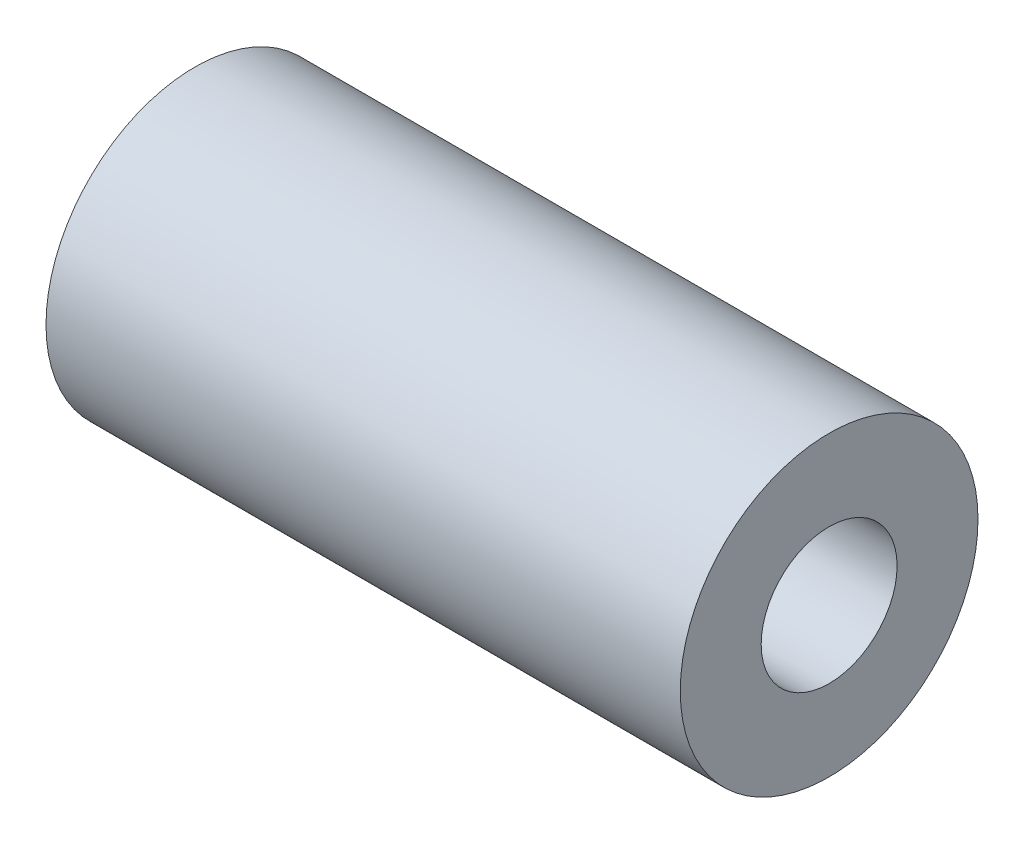
ISO-10303-21;
HEADER;
FILE_DESCRIPTION(('STEP AP214'),'2;1');
FILE_NAME('part.step','',(''),(''),'','','');
FILE_SCHEMA(('AUTOMOTIVE_DESIGN { 1 0 10303 214 1 1 1 1 }'));
ENDSEC;
DATA;
#1=APPLICATION_CONTEXT('core data for automotive mechanical design processes');
#2=APPLICATION_PROTOCOL_DEFINITION('international standard','automotive_design',2000,#1);
#3=PRODUCT_CONTEXT('',#1,'mechanical');
#4=PRODUCT('Part','Part','',(#3));
#5=PRODUCT_RELATED_PRODUCT_CATEGORY('part','',(#4));
#6=PRODUCT_DEFINITION_FORMATION('','',#4);
#7=PRODUCT_DEFINITION_CONTEXT('part definition',#1,'design');
#8=PRODUCT_DEFINITION('design','',#6,#7);
#9=PRODUCT_DEFINITION_SHAPE('','',#8);
#10=(LENGTH_UNIT() NAMED_UNIT(*) SI_UNIT(.MILLI.,.METRE.));
#11=(NAMED_UNIT(*) PLANE_ANGLE_UNIT() SI_UNIT($,.RADIAN.));
#12=(NAMED_UNIT(*) SI_UNIT($,.STERADIAN.) SOLID_ANGLE_UNIT());
#13=UNCERTAINTY_MEASURE_WITH_UNIT(LENGTH_MEASURE(1.E-05),#10,'distance_accuracy_value','');
#14=(GEOMETRIC_REPRESENTATION_CONTEXT(3) GLOBAL_UNCERTAINTY_ASSIGNED_CONTEXT((#13)) GLOBAL_UNIT_ASSIGNED_CONTEXT((#10,
#11,#12)) REPRESENTATION_CONTEXT('',''));
#15=CARTESIAN_POINT('',(0.,0.,0.));
#16=DIRECTION('',(0.,0.,1.));
#17=DIRECTION('',(1.,0.,0.));
#18=AXIS2_PLACEMENT_3D('',#15,#16,#17);
#19=CARTESIAN_POINT('',(124.510764773832,16.8644967312993,16.8644967312991));
#20=DIRECTION('',(-1.,0.,0.));
#21=DIRECTION('',(0.,0.,1.));
#22=AXIS2_PLACEMENT_3D('',#19,#20,#21);
#23=CYLINDRICAL_SURFACE('',#22,4.6);
#24=CARTESIAN_POINT('',(91.9,16.8644967312993,16.8644967312991));
#25=DIRECTION('',(-1.,0.,0.));
#26=DIRECTION('',(0.,0.,1.));
#27=AXIS2_PLACEMENT_3D('',#24,#25,#26);
#28=CIRCLE('',#27,4.6);
#29=CARTESIAN_POINT('',(91.9,16.8644967312993,21.4644967312991));
#30=VERTEX_POINT('',#29);
#31=EDGE_CURVE('E58',#30,#30,#28,.F.);
#32=ORIENTED_EDGE('',*,*,#31,.T.);
#33=EDGE_LOOP('',(#32));
#34=FACE_BOUND('',#33,.T.);
#35=CARTESIAN_POINT('',(111.5,16.8644967312993,16.8644967312991));
#36=DIRECTION('',(1.,0.,0.));
#37=DIRECTION('',(0.,0.,-1.));
#38=AXIS2_PLACEMENT_3D('',#35,#36,#37);
#39=CIRCLE('',#38,4.6);
#40=CARTESIAN_POINT('',(111.5,16.8644967312993,12.2644967312991));
#41=VERTEX_POINT('',#40);
#42=EDGE_CURVE('E47',#41,#41,#39,.F.);
#43=ORIENTED_EDGE('',*,*,#42,.T.);
#44=EDGE_LOOP('',(#43));
#45=FACE_BOUND('',#44,.T.);
#46=ADVANCED_FACE('F43',(#34,#45),#23,.T.);
#47=CARTESIAN_POINT('',(124.510764773832,16.8644967312993,16.8644967312991));
#48=DIRECTION('',(-1.,0.,0.));
#49=DIRECTION('',(0.,0.,1.));
#50=AXIS2_PLACEMENT_3D('',#47,#48,#49);
#51=CYLINDRICAL_SURFACE('',#50,2.10000000000001);
#52=CARTESIAN_POINT('',(111.5,16.8644967312993,16.8644967312991));
#53=DIRECTION('',(1.,0.,0.));
#54=DIRECTION('',(0.,0.,-1.));
#55=AXIS2_PLACEMENT_3D('',#52,#53,#54);
#56=CIRCLE('',#55,2.10000000000001);
#57=CARTESIAN_POINT('',(111.5,16.8644967312993,14.7644967312991));
#58=VERTEX_POINT('',#57);
#59=EDGE_CURVE('E11',#58,#58,#56,.F.);
#60=ORIENTED_EDGE('',*,*,#59,.F.);
#61=EDGE_LOOP('',(#60));
#62=FACE_BOUND('',#61,.T.);
#63=CARTESIAN_POINT('',(91.9,16.8644967312993,16.8644967312991));
#64=DIRECTION('',(-1.,0.,0.));
#65=DIRECTION('',(0.,0.,1.));
#66=AXIS2_PLACEMENT_3D('',#63,#64,#65);
#67=CIRCLE('',#66,2.10000000000001);
#68=CARTESIAN_POINT('',(91.9,16.8644967312993,18.9644967312991));
#69=VERTEX_POINT('',#68);
#70=EDGE_CURVE('E54',#69,#69,#67,.F.);
#71=ORIENTED_EDGE('',*,*,#70,.F.);
#72=EDGE_LOOP('',(#71));
#73=FACE_BOUND('',#72,.T.);
#74=ADVANCED_FACE('F70',(#62,#73),#51,.F.);
#75=CARTESIAN_POINT('',(111.5,0.,0.));
#76=DIRECTION('',(1.,0.,0.));
#77=DIRECTION('',(0.,0.,-1.));
#78=AXIS2_PLACEMENT_3D('',#75,#76,#77);
#79=PLANE('',#78);
#80=ORIENTED_EDGE('',*,*,#42,.F.);
#81=EDGE_LOOP('',(#80));
#82=FACE_BOUND('',#81,.T.);
#83=ORIENTED_EDGE('',*,*,#59,.T.);
#84=EDGE_LOOP('',(#83));
#85=FACE_BOUND('',#84,.T.);
#86=ADVANCED_FACE('F45',(#82,#85),#79,.T.);
#87=CARTESIAN_POINT('',(91.9,0.,0.));
#88=DIRECTION('',(-1.,0.,0.));
#89=DIRECTION('',(0.,0.,1.));
#90=AXIS2_PLACEMENT_3D('',#87,#88,#89);
#91=PLANE('',#90);
#92=ORIENTED_EDGE('',*,*,#31,.F.);
#93=EDGE_LOOP('',(#92));
#94=FACE_BOUND('',#93,.T.);
#95=ORIENTED_EDGE('',*,*,#70,.T.);
#96=EDGE_LOOP('',(#95));
#97=FACE_BOUND('',#96,.T.);
#98=ADVANCED_FACE('F64',(#94,#97),#91,.T.);
#99=CLOSED_SHELL('',(#46,#74,#86,#98));
#100=MANIFOLD_SOLID_BREP('B2',#99);
#101=ADVANCED_BREP_SHAPE_REPRESENTATION('',(#18,#100),#14);
#102=SHAPE_DEFINITION_REPRESENTATION(#9,#101);
ENDSEC;
END-ISO-10303-21;
